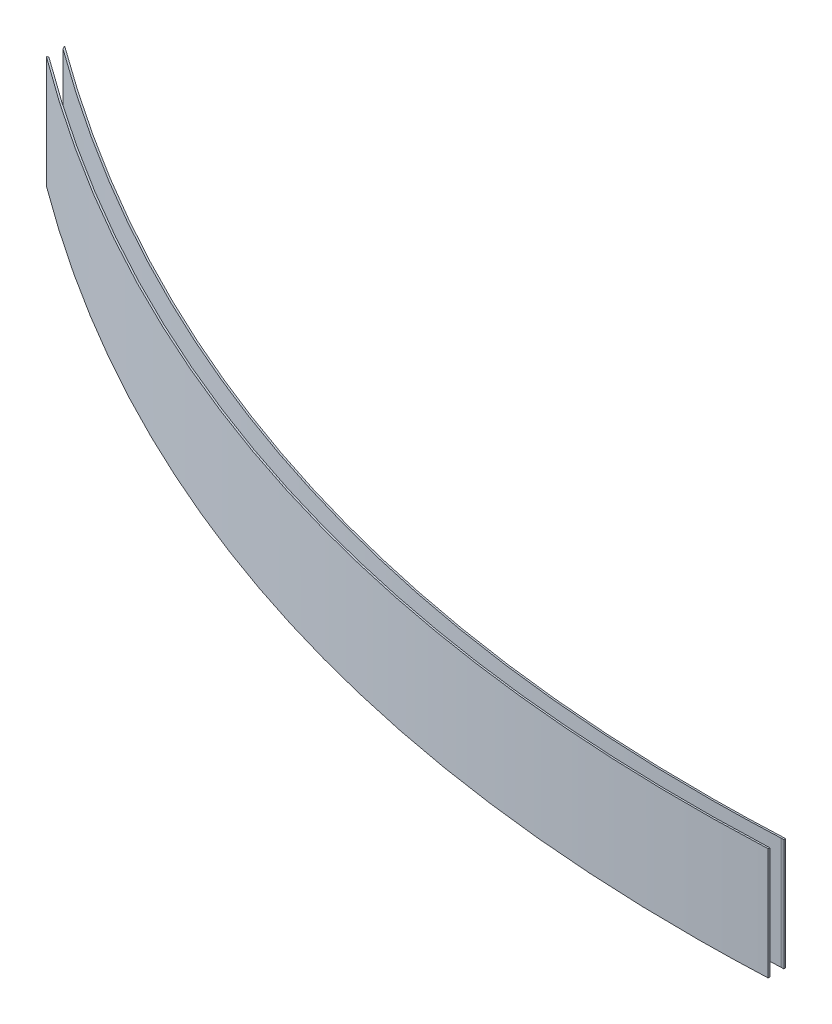
ISO-10303-21;
HEADER;
FILE_DESCRIPTION(('STEP AP214'),'2;1');
FILE_NAME('part.step','',(''),(''),'','','');
FILE_SCHEMA(('AUTOMOTIVE_DESIGN { 1 0 10303 214 1 1 1 1 }'));
ENDSEC;
DATA;
#1=APPLICATION_CONTEXT('core data for automotive mechanical design processes');
#2=APPLICATION_PROTOCOL_DEFINITION('international standard','automotive_design',2000,#1);
#3=PRODUCT_CONTEXT('',#1,'mechanical');
#4=PRODUCT('Part','Part','',(#3));
#5=PRODUCT_RELATED_PRODUCT_CATEGORY('part','',(#4));
#6=PRODUCT_DEFINITION_FORMATION('','',#4);
#7=PRODUCT_DEFINITION_CONTEXT('part definition',#1,'design');
#8=PRODUCT_DEFINITION('design','',#6,#7);
#9=PRODUCT_DEFINITION_SHAPE('','',#8);
#10=(LENGTH_UNIT() NAMED_UNIT(*) SI_UNIT(.MILLI.,.METRE.));
#11=(NAMED_UNIT(*) PLANE_ANGLE_UNIT() SI_UNIT($,.RADIAN.));
#12=(NAMED_UNIT(*) SI_UNIT($,.STERADIAN.) SOLID_ANGLE_UNIT());
#13=UNCERTAINTY_MEASURE_WITH_UNIT(LENGTH_MEASURE(1.E-05),#10,'distance_accuracy_value','');
#14=(GEOMETRIC_REPRESENTATION_CONTEXT(3) GLOBAL_UNCERTAINTY_ASSIGNED_CONTEXT((#13)) GLOBAL_UNIT_ASSIGNED_CONTEXT((#10,
#11,#12)) REPRESENTATION_CONTEXT('',''));
#15=CARTESIAN_POINT('',(0.,0.,0.));
#16=DIRECTION('',(0.,0.,1.));
#17=DIRECTION('',(1.,0.,0.));
#18=AXIS2_PLACEMENT_3D('',#15,#16,#17);
#19=CARTESIAN_POINT('',(-236.084098565073,705.3,-330.26408566738));
#20=DIRECTION('',(0.,1.,0.));
#21=DIRECTION('',(0.,0.,-1.));
#22=AXIS2_PLACEMENT_3D('',#19,#20,#21);
#23=PLANE('',#22);
#24=CARTESIAN_POINT('',(-65.6029870038505,705.3,-318.310693139276));
#25=CARTESIAN_POINT('',(-68.2691629825036,705.3,-318.183187046416));
#26=CARTESIAN_POINT('',(-70.9361555522906,705.3,-318.073376106954));
#27=CARTESIAN_POINT('',(-76.2713852542856,705.3,-317.889522387255));
#28=CARTESIAN_POINT('',(-78.9396223923947,705.3,-317.815479778372));
#29=CARTESIAN_POINT('',(-86.9473862895726,705.3,-317.647534916938));
#30=CARTESIAN_POINT('',(-92.2881597578225,705.3,-317.607902482869));
#31=CARTESIAN_POINT('',(-102.969854987151,705.3,-317.676073655154));
#32=CARTESIAN_POINT('',(-108.310776538044,705.3,-317.783908630168));
#33=CARTESIAN_POINT('',(-118.988092612427,705.3,-318.149436114162));
#34=CARTESIAN_POINT('',(-124.324486600366,705.3,-318.407144392248));
#35=CARTESIAN_POINT('',(-134.987971328782,705.3,-319.07437400729));
#36=CARTESIAN_POINT('',(-140.315061744115,705.3,-319.483900547421));
#37=CARTESIAN_POINT('',(-150.955217209216,705.3,-320.456234020843));
#38=CARTESIAN_POINT('',(-156.268282363942,705.3,-321.01903980378));
#39=CARTESIAN_POINT('',(-166.725987822131,705.3,-322.280831390952));
#40=CARTESIAN_POINT('',(-171.871146588405,705.3,-322.975521744442));
#41=CARTESIAN_POINT('',(-182.139119469575,705.3,-324.510919792214));
#42=CARTESIAN_POINT('',(-187.261935758724,705.3,-325.351612937876));
#43=CARTESIAN_POINT('',(-197.480920878812,705.3,-327.178919893074));
#44=CARTESIAN_POINT('',(-202.577092472965,705.3,-328.165518247619));
#45=CARTESIAN_POINT('',(-212.738589982239,705.3,-330.284063891744));
#46=CARTESIAN_POINT('',(-217.803919000081,705.3,-331.415996299166));
#47=CARTESIAN_POINT('',(-227.899635885535,705.3,-333.824165958377));
#48=CARTESIAN_POINT('',(-232.930027115684,705.3,-335.100389112966));
#49=CARTESIAN_POINT('',(-242.95185071161,705.3,-337.795614070396));
#50=CARTESIAN_POINT('',(-247.943286938129,705.3,-339.214601525475));
#51=CARTESIAN_POINT('',(-258.337345800253,705.3,-342.329437078258));
#52=CARTESIAN_POINT('',(-263.735942949794,705.3,-344.038732873943));
#53=CARTESIAN_POINT('',(-274.478583579159,705.3,-347.622282235918));
#54=CARTESIAN_POINT('',(-279.822622351469,705.3,-349.496549904616));
#55=CARTESIAN_POINT('',(-290.452310891855,705.3,-353.406660143415));
#56=CARTESIAN_POINT('',(-295.737950192759,705.3,-355.442531159847));
#57=CARTESIAN_POINT('',(-306.247175913095,705.3,-359.671966618089));
#58=CARTESIAN_POINT('',(-311.470747397068,705.3,-361.865568153882));
#59=CARTESIAN_POINT('',(-321.852374785991,705.3,-366.406113074929));
#60=CARTESIAN_POINT('',(-327.010413603648,705.3,-368.753095511605));
#61=CARTESIAN_POINT('',(-337.25768706161,705.3,-373.595592323015));
#62=CARTESIAN_POINT('',(-342.346905760605,705.3,-376.091140411643));
#63=CARTESIAN_POINT('',(-352.613968550303,705.3,-381.307086611694));
#64=CARTESIAN_POINT('',(-357.78945789645,705.3,-384.032118792804));
#65=CARTESIAN_POINT('',(-368.060581589295,705.3,-389.628462780461));
#66=CARTESIAN_POINT('',(-373.156217142842,705.3,-392.499772373491));
#67=CARTESIAN_POINT('',(-383.264815106663,705.3,-398.382127543981));
#68=CARTESIAN_POINT('',(-388.277793355456,705.3,-401.393145919068));
#69=CARTESIAN_POINT('',(-398.218479836666,705.3,-407.548011019785));
#70=CARTESIAN_POINT('',(-403.146224129469,705.3,-410.691799535078));
#71=CARTESIAN_POINT('',(-412.914028216126,705.3,-417.104955927536));
#72=CARTESIAN_POINT('',(-417.754150109865,705.3,-420.37422929732));
#73=CARTESIAN_POINT('',(-427.344583874759,705.3,-427.030819664629));
#74=CARTESIAN_POINT('',(-432.094989578501,705.3,-430.418001436099));
#75=CARTESIAN_POINT('',(-436.802987231457,705.3,-433.862922308594));
#76=B_SPLINE_CURVE_WITH_KNOTS('',3,(#24,#25,#26,#27,#28,#29,#30,#31,#32,#33,#34,#35,#36,#37,#38,
#39,#40,#41,#42,#43,#44,#45,#46,#47,#48,#49,#50,#51,#52,#53,#54,#55,#56,#57,#58,#59,#60,#61,#62,
#63,#64,#65,#66,#67,#68,#69,#70,#71,#72,#73,#74,#75),.UNSPECIFIED.,.F.,.F.,(4,2,2,2,2,2,2,2,2,2,
2,2,2,2,2,2,2,2,2,2,2,2,2,2,2,4),(0.,8.00754857334855,16.0151355077293,32.0357311751262,
48.0597352075981,64.0854255306863,80.1116651432765,96.1377844827726,111.711241231546,
127.283147034395,142.853404564952,158.422068976126,173.989213641732,189.554795374637,
206.540261002934,223.527180024817,240.517095839147,257.511020376539,274.509288623075,
291.511429087807,309.056157780186,326.600621058968,344.141682514485,361.675131707691,
379.195625386035,396.696647608506),.UNSPECIFIED.);
#77=CARTESIAN_POINT('',(-65.6029870038505,705.3,-318.310693139276));
#78=VERTEX_POINT('',#77);
#79=CARTESIAN_POINT('',(-436.80298723145,705.3,-433.862922308592));
#80=VERTEX_POINT('',#79);
#81=EDGE_CURVE('E111',#78,#80,#76,.T.);
#82=ORIENTED_EDGE('',*,*,#81,.F.);
#83=DIRECTION('',(3.33598704164609E-09,0.,-1.));
#84=VECTOR('',#83,1.);
#85=CARTESIAN_POINT('',(-65.6029870059495,705.3,-317.681641946463));
#86=LINE('',#85,#84);
#87=CARTESIAN_POINT('',(-65.6029870059495,705.3,-317.681641948464));
#88=VERTEX_POINT('',#87);
#89=EDGE_CURVE('E119',#88,#78,#86,.T.);
#90=ORIENTED_EDGE('',*,*,#89,.F.);
#91=DIRECTION('',(1.,0.,0.));
#92=VECTOR('',#91,1.);
#93=CARTESIAN_POINT('',(-236.084098565073,705.3,-317.681641948464));
#94=LINE('',#93,#92);
#95=CARTESIAN_POINT('',(-66.2029870059553,705.3,-317.681641948464));
#96=VERTEX_POINT('',#95);
#97=EDGE_CURVE('E150',#96,#88,#94,.T.);
#98=ORIENTED_EDGE('',*,*,#97,.F.);
#99=DIRECTION('',(0.998921745490793,0.,-0.0464257082404532));
#100=VECTOR('',#99,1.);
#101=CARTESIAN_POINT('',(-66.564204214343,705.3,-317.664854082143));
#102=LINE('',#101,#100);
#103=CARTESIAN_POINT('',(-66.564204214343,705.3,-317.664854082143));
#104=VERTEX_POINT('',#103);
#105=EDGE_CURVE('E155',#104,#96,#102,.T.);
#106=ORIENTED_EDGE('',*,*,#105,.F.);
#107=CARTESIAN_POINT('',(179399.129928406,705.3,-984620.675822957));
#108=CARTESIAN_POINT('',(-212077.093758222,705.3,976969.386915229));
#109=CARTESIAN_POINT('',(243907.016921872,705.3,-970636.245329767));
#110=B_SPLINE_CURVE_WITH_KNOTS('',2,(#107,#108,#109),.UNSPECIFIED.,.F.,.F.,(3,3),(0.,1.),.UNSPECIFIED.);
#111=CARTESIAN_POINT('',(-66.5668764567506,705.3,-317.664729887484));
#112=VERTEX_POINT('',#111);
#113=EDGE_CURVE('E128',#104,#112,#110,.F.);
#114=ORIENTED_EDGE('',*,*,#113,.T.);
#115=CARTESIAN_POINT('',(-436.202987182509,705.3,-432.681642064262));
#116=VERTEX_POINT('',#115);
#117=EDGE_CURVE('E129',#112,#116,#110,.F.);
#118=ORIENTED_EDGE('',*,*,#117,.T.);
#119=DIRECTION('',(0.452856269308282,0.,0.891583534700022));
#120=VECTOR('',#119,1.);
#121=CARTESIAN_POINT('',(-353.810815566412,705.3,-270.467914266485));
#122=LINE('',#121,#120);
#123=EDGE_CURVE('E124',#80,#116,#122,.T.);
#124=ORIENTED_EDGE('',*,*,#123,.F.);
#125=EDGE_LOOP('',(#82,#90,#98,#106,#114,#118,#124));
#126=FACE_BOUND('',#125,.T.);
#127=ADVANCED_FACE('F47',(#126),#23,.F.);
#128=CARTESIAN_POINT('',(-212.010166541518,745.,-329.536830566326));
#129=DIRECTION('',(0.,1.,0.));
#130=DIRECTION('',(0.,0.,-1.));
#131=AXIS2_PLACEMENT_3D('',#128,#129,#130);
#132=PLANE('',#131);
#133=DIRECTION('',(0.452856269308282,0.,0.891583534700022));
#134=VECTOR('',#133,1.);
#135=CARTESIAN_POINT('',(-436.202987182509,745.,-432.681642064262));
#136=LINE('',#135,#134);
#137=CARTESIAN_POINT('',(-436.80298723145,745.,-433.862922308592));
#138=VERTEX_POINT('',#137);
#139=CARTESIAN_POINT('',(-436.202987182509,745.,-432.681642064262));
#140=VERTEX_POINT('',#139);
#141=EDGE_CURVE('E12',#138,#140,#136,.T.);
#142=ORIENTED_EDGE('',*,*,#141,.T.);
#143=CARTESIAN_POINT('',(179399.129928406,745.,-984620.675822957));
#144=CARTESIAN_POINT('',(-212077.093758222,745.,976969.386915229));
#145=CARTESIAN_POINT('',(243907.016921872,745.,-970636.245329767));
#146=B_SPLINE_CURVE_WITH_KNOTS('',2,(#143,#144,#145),.UNSPECIFIED.,.F.,.F.,(3,3),(0.,1.),.UNSPECIFIED.);
#147=CARTESIAN_POINT('',(-66.5668764558678,745.,-317.664729884103));
#148=VERTEX_POINT('',#147);
#149=EDGE_CURVE('E131',#140,#148,#146,.T.);
#150=ORIENTED_EDGE('',*,*,#149,.T.);
#151=DIRECTION('',(0.998921745490792,0.,-0.0464257082404641));
#152=VECTOR('',#151,1.);
#153=CARTESIAN_POINT('',(-66.5642042129753,745.,-317.664854082207));
#154=LINE('',#153,#152);
#155=CARTESIAN_POINT('',(-66.2029870059495,745.,-317.681641948464));
#156=VERTEX_POINT('',#155);
#157=EDGE_CURVE('E139',#156,#148,#154,.F.);
#158=ORIENTED_EDGE('',*,*,#157,.F.);
#159=DIRECTION('',(1.,0.,0.));
#160=VECTOR('',#159,1.);
#161=CARTESIAN_POINT('',(-66.2029870059495,745.,-317.681641948464));
#162=LINE('',#161,#160);
#163=CARTESIAN_POINT('',(-65.6029870038505,745.,-317.681641948464));
#164=VERTEX_POINT('',#163);
#165=EDGE_CURVE('E157',#156,#164,#162,.T.);
#166=ORIENTED_EDGE('',*,*,#165,.T.);
#167=DIRECTION('',(-3.33598704164609E-09,0.,1.));
#168=VECTOR('',#167,1.);
#169=CARTESIAN_POINT('',(-65.6029869664008,745.,-329.536830077914));
#170=LINE('',#169,#168);
#171=CARTESIAN_POINT('',(-65.6029870038505,745.,-318.310693139276));
#172=VERTEX_POINT('',#171);
#173=EDGE_CURVE('E51',#172,#164,#170,.T.);
#174=ORIENTED_EDGE('',*,*,#173,.F.);
#175=CARTESIAN_POINT('',(-436.80298723145,745.,-433.862922308592));
#176=CARTESIAN_POINT('',(-432.279255756403,745.,-430.55283592515));
#177=CARTESIAN_POINT('',(-427.716380805868,745.,-427.296059412836));
#178=CARTESIAN_POINT('',(-418.50825169473,745.,-420.891282643582));
#179=CARTESIAN_POINT('',(-413.86292067398,745.,-417.743392916555));
#180=CARTESIAN_POINT('',(-404.491646218644,745.,-411.563075128013));
#181=CARTESIAN_POINT('',(-399.765651911941,745.,-408.530724147033));
#182=CARTESIAN_POINT('',(-390.235068970205,745.,-402.587926236768));
#183=CARTESIAN_POINT('',(-385.430450818185,745.,-399.677526621532));
#184=CARTESIAN_POINT('',(-375.744798513768,745.,-393.984783776664));
#185=CARTESIAN_POINT('',(-370.863751469657,745.,-391.20246246949));
#186=CARTESIAN_POINT('',(-361.027611925824,745.,-385.771719612806));
#187=CARTESIAN_POINT('',(-356.072518596553,745.,-383.123299564861));
#188=CARTESIAN_POINT('',(-346.238770653325,745.,-378.042292576845));
#189=CARTESIAN_POINT('',(-341.362222313244,745.,-375.605630019498));
#190=CARTESIAN_POINT('',(-331.544616363603,745.,-370.868404442039));
#191=CARTESIAN_POINT('',(-326.603571709451,745.,-368.567814587249));
#192=CARTESIAN_POINT('',(-316.659747663615,745.,-364.107101569605));
#193=CARTESIAN_POINT('',(-311.656981986963,745.,-361.946947846233));
#194=CARTESIAN_POINT('',(-301.592643904598,745.,-357.771088333706));
#195=CARTESIAN_POINT('',(-296.531083180593,745.,-355.755354402228));
#196=CARTESIAN_POINT('',(-286.352250622464,745.,-351.871919508155));
#197=CARTESIAN_POINT('',(-281.234986407354,745.,-350.004198582943));
#198=CARTESIAN_POINT('',(-270.948010590076,745.,-346.419961853068));
#199=CARTESIAN_POINT('',(-265.778301322965,745.,-344.703439349132));
#200=CARTESIAN_POINT('',(-255.429941826647,745.,-341.436991397288));
#201=CARTESIAN_POINT('',(-250.251661926368,745.,-339.885892915898));
#202=CARTESIAN_POINT('',(-239.850713429572,745.,-336.937627705568));
#203=CARTESIAN_POINT('',(-234.628039042734,745.,-335.54048139885));
#204=CARTESIAN_POINT('',(-224.142786614678,745.,-332.902097236991));
#205=CARTESIAN_POINT('',(-218.880203866106,745.,-331.660878087223));
#206=CARTESIAN_POINT('',(-208.319742254665,745.,-329.335763154947));
#207=CARTESIAN_POINT('',(-203.021859272459,745.,-328.251886081979));
#208=CARTESIAN_POINT('',(-192.395526399523,745.,-326.24230965986));
#209=CARTESIAN_POINT('',(-187.06707294104,745.,-325.316629177942));
#210=CARTESIAN_POINT('',(-176.384459892603,745.,-323.623741533817));
#211=CARTESIAN_POINT('',(-171.03029752171,745.,-322.856551929623));
#212=CARTESIAN_POINT('',(-160.139781371167,745.,-321.459677679548));
#213=CARTESIAN_POINT('',(-154.602805468541,745.,-320.834841283108));
#214=CARTESIAN_POINT('',(-143.512527106277,745.,-319.752161807083));
#215=CARTESIAN_POINT('',(-137.959224503256,745.,-319.294320198505));
#216=CARTESIAN_POINT('',(-126.841646292097,745.,-318.544085155538));
#217=CARTESIAN_POINT('',(-121.277371038054,745.,-318.251686467104));
#218=CARTESIAN_POINT('',(-110.143266246472,745.,-317.830220995766));
#219=CARTESIAN_POINT('',(-104.573437348723,745.,-317.701137181789));
#220=CARTESIAN_POINT('',(-93.4335333401742,745.,-317.603642572535));
#221=CARTESIAN_POINT('',(-87.863458546735,745.,-317.635196817593));
#222=CARTESIAN_POINT('',(-79.5119150084561,745.,-317.800639622011));
#223=CARTESIAN_POINT('',(-76.7291522792474,745.,-317.875448867259));
#224=CARTESIAN_POINT('',(-71.1649597337781,745.,-318.063987860901));
#225=CARTESIAN_POINT('',(-68.3835299103828,745.,-318.177717398576));
#226=CARTESIAN_POINT('',(-65.6029870038505,745.,-318.310693139276));
#227=B_SPLINE_CURVE_WITH_KNOTS('',3,(#175,#176,#177,#178,#179,#180,#181,#182,#183,#184,#185,
#186,#187,#188,#189,#190,#191,#192,#193,#194,#195,#196,#197,#198,#199,#200,#201,#202,#203,#204,
#205,#206,#207,#208,#209,#210,#211,#212,#213,#214,#215,#216,#217,#218,#219,#220,#221,#222,#223,
#224,#225,#226),.UNSPECIFIED.,.F.,.F.,(4,2,2,2,2,2,2,2,2,2,2,2,2,2,2,2,2,2,2,2,2,2,2,2,2,4),(0.,
16.8160550823314,33.6487068955703,50.4923985401429,67.3425657215014,84.1956064097527,
101.04883604582,117.401086820433,133.750101967623,150.095547389379,166.437798948294,
182.777842652134,199.117161999722,215.331599508683,231.548185329037,247.766714673516,
263.987170985665,280.209560473995,296.433746156341,313.147539689226,329.861480445417,
346.574890379593,363.286557234338,379.994587284088,388.345657910788,396.696683324666),.UNSPECIFIED.);
#228=EDGE_CURVE('E108',#138,#172,#227,.T.);
#229=ORIENTED_EDGE('',*,*,#228,.F.);
#230=EDGE_LOOP('',(#142,#150,#158,#166,#174,#229));
#231=FACE_BOUND('',#230,.T.);
#232=ADVANCED_FACE('F115',(#231),#132,.T.);
#233=CARTESIAN_POINT('',(179399.129928406,314.960432392313,-984620.675822957));
#234=CARTESIAN_POINT('',(-212077.093758222,314.960432392313,976969.386915229));
#235=CARTESIAN_POINT('',(243907.016921872,314.960432392313,-970636.245329767));
#236=B_SPLINE_CURVE_WITH_KNOTS('',2,(#233,#234,#235),.UNSPECIFIED.,.F.,.F.,(3,3),(0.,1.),.UNSPECIFIED.);
#237=DIRECTION('',(0.,1.,0.));
#238=VECTOR('',#237,1.);
#239=SURFACE_OF_LINEAR_EXTRUSION('',#236,#238);
#240=OFFSET_SURFACE('',#239,-0.6,.F.);
#241=ORIENTED_EDGE('',*,*,#81,.T.);
#242=DIRECTION('',(0.,1.,0.));
#243=VECTOR('',#242,1.);
#244=CARTESIAN_POINT('',(-436.802987231448,705.3,-433.862922308592));
#245=LINE('',#244,#243);
#246=EDGE_CURVE('E57',#80,#138,#245,.T.);
#247=ORIENTED_EDGE('',*,*,#246,.T.);
#248=ORIENTED_EDGE('',*,*,#228,.T.);
#249=DIRECTION('',(0.,1.,0.));
#250=VECTOR('',#249,1.);
#251=CARTESIAN_POINT('',(-65.6029870038505,705.3,-318.310693139276));
#252=LINE('',#251,#250);
#253=EDGE_CURVE('E136',#78,#172,#252,.T.);
#254=ORIENTED_EDGE('',*,*,#253,.F.);
#255=EDGE_LOOP('',(#241,#247,#248,#254));
#256=FACE_BOUND('',#255,.T.);
#257=ADVANCED_FACE('F107',(#256),#240,.F.);
#258=CARTESIAN_POINT('',(-65.6029870059495,314.960432392313,-317.681641946463));
#259=DIRECTION('',(1.,0.,3.33598704164609E-09));
#260=DIRECTION('',(-3.33598704164609E-09,0.,1.));
#261=AXIS2_PLACEMENT_3D('',#258,#259,#260);
#262=PLANE('',#261);
#263=DIRECTION('',(0.,-1.,0.));
#264=VECTOR('',#263,1.);
#265=CARTESIAN_POINT('',(-65.6029870059495,314.960432392313,-317.681641948464));
#266=LINE('',#265,#264);
#267=EDGE_CURVE('E112',#164,#88,#266,.T.);
#268=ORIENTED_EDGE('',*,*,#267,.T.);
#269=ORIENTED_EDGE('',*,*,#89,.T.);
#270=ORIENTED_EDGE('',*,*,#253,.T.);
#271=ORIENTED_EDGE('',*,*,#173,.T.);
#272=EDGE_LOOP('',(#268,#269,#270,#271));
#273=FACE_BOUND('',#272,.T.);
#274=ADVANCED_FACE('F164',(#273),#262,.T.);
#275=CARTESIAN_POINT('',(179399.129928406,314.960432392313,-984620.675822957));
#276=CARTESIAN_POINT('',(-212077.093758222,314.960432392313,976969.386915229));
#277=CARTESIAN_POINT('',(243907.016921872,314.960432392313,-970636.245329767));
#278=B_SPLINE_CURVE_WITH_KNOTS('',2,(#275,#276,#277),.UNSPECIFIED.,.F.,.F.,(3,3),(0.,1.),.UNSPECIFIED.);
#279=DIRECTION('',(0.,1.,0.));
#280=VECTOR('',#279,1.);
#281=SURFACE_OF_LINEAR_EXTRUSION('',#278,#280);
#282=ORIENTED_EDGE('',*,*,#149,.F.);
#283=DIRECTION('',(0.,1.,0.));
#284=VECTOR('',#283,1.);
#285=CARTESIAN_POINT('',(-436.202987182509,314.960432392313,-432.681642064262));
#286=LINE('',#285,#284);
#287=EDGE_CURVE('E122',#116,#140,#286,.T.);
#288=ORIENTED_EDGE('',*,*,#287,.F.);
#289=ORIENTED_EDGE('',*,*,#117,.F.);
#290=DIRECTION('',(0.,1.,0.));
#291=VECTOR('',#290,1.);
#292=CARTESIAN_POINT('',(-66.5668764567506,685.,-317.664729887484));
#293=LINE('',#292,#291);
#294=EDGE_CURVE('E133',#112,#148,#293,.T.);
#295=ORIENTED_EDGE('',*,*,#294,.T.);
#296=EDGE_LOOP('',(#282,#288,#289,#295));
#297=FACE_BOUND('',#296,.T.);
#298=ADVANCED_FACE('F132',(#297),#281,.T.);
#299=CARTESIAN_POINT('',(-66.5668764567506,685.,-317.664729887484));
#300=DIRECTION('',(-0.0464257082403459,0.,-0.998921745490798));
#301=DIRECTION('',(0.998921745490798,0.,-0.0464257082403459));
#302=AXIS2_PLACEMENT_3D('',#299,#300,#301);
#303=PLANE('',#302);
#304=ORIENTED_EDGE('',*,*,#113,.F.);
#305=ORIENTED_EDGE('',*,*,#105,.T.);
#306=DIRECTION('',(0.,1.,0.));
#307=VECTOR('',#306,1.);
#308=CARTESIAN_POINT('',(-66.2029870059495,685.,-317.681641948464));
#309=LINE('',#308,#307);
#310=EDGE_CURVE('E101',#96,#156,#309,.T.);
#311=ORIENTED_EDGE('',*,*,#310,.T.);
#312=ORIENTED_EDGE('',*,*,#157,.T.);
#313=ORIENTED_EDGE('',*,*,#294,.F.);
#314=EDGE_LOOP('',(#304,#305,#311,#312,#313));
#315=FACE_BOUND('',#314,.T.);
#316=ADVANCED_FACE('F185',(#315),#303,.F.);
#317=CARTESIAN_POINT('',(-66.2029870059495,685.,-317.681641948464));
#318=DIRECTION('',(0.,0.,-1.));
#319=DIRECTION('',(1.,0.,0.));
#320=AXIS2_PLACEMENT_3D('',#317,#318,#319);
#321=PLANE('',#320);
#322=ORIENTED_EDGE('',*,*,#310,.F.);
#323=ORIENTED_EDGE('',*,*,#97,.T.);
#324=ORIENTED_EDGE('',*,*,#267,.F.);
#325=ORIENTED_EDGE('',*,*,#165,.F.);
#326=EDGE_LOOP('',(#322,#323,#324,#325));
#327=FACE_BOUND('',#326,.T.);
#328=ADVANCED_FACE('F194',(#327),#321,.F.);
#329=CARTESIAN_POINT('',(-436.202987182509,685.,-432.681642064262));
#330=DIRECTION('',(0.891583534700022,0.,-0.452856269308282));
#331=DIRECTION('',(0.452856269308282,0.,0.891583534700022));
#332=AXIS2_PLACEMENT_3D('',#329,#330,#331);
#333=PLANE('',#332);
#334=ORIENTED_EDGE('',*,*,#246,.F.);
#335=ORIENTED_EDGE('',*,*,#123,.T.);
#336=ORIENTED_EDGE('',*,*,#287,.T.);
#337=ORIENTED_EDGE('',*,*,#141,.F.);
#338=EDGE_LOOP('',(#334,#335,#336,#337));
#339=FACE_BOUND('',#338,.T.);
#340=ADVANCED_FACE('F121',(#339),#333,.F.);
#341=CLOSED_SHELL('',(#127,#232,#257,#274,#298,#316,#328,#340));
#342=MANIFOLD_SOLID_BREP('B2',#341);
#343=CARTESIAN_POINT('',(-65.6029870059495,314.960432392313,-317.681641946463));
#344=DIRECTION('',(1.,0.,3.33598704164609E-09));
#345=DIRECTION('',(-3.33598704164609E-09,0.,1.));
#346=AXIS2_PLACEMENT_3D('',#343,#344,#345);
#347=PLANE('',#346);
#348=DIRECTION('',(0.,1.,0.));
#349=VECTOR('',#348,1.);
#350=CARTESIAN_POINT('',(-65.6029870226558,314.960432392313,-312.673734300305));
#351=LINE('',#350,#349);
#352=CARTESIAN_POINT('',(-65.6029870226558,705.3,-312.673734300305));
#353=VERTEX_POINT('',#352);
#354=CARTESIAN_POINT('',(-65.6029870038505,745.,-312.673734300454));
#355=VERTEX_POINT('',#354);
#356=EDGE_CURVE('E369',#353,#355,#351,.T.);
#357=ORIENTED_EDGE('',*,*,#356,.T.);
#358=DIRECTION('',(-3.33598704164609E-09,0.,1.));
#359=VECTOR('',#358,1.);
#360=CARTESIAN_POINT('',(-65.6029869664008,745.,-329.536830077914));
#361=LINE('',#360,#359);
#362=CARTESIAN_POINT('',(-65.6029870245519,745.,-312.107195518563));
#363=VERTEX_POINT('',#362);
#364=EDGE_CURVE('E325',#355,#363,#361,.T.);
#365=ORIENTED_EDGE('',*,*,#364,.T.);
#366=DIRECTION('',(0.,1.,0.));
#367=VECTOR('',#366,1.);
#368=CARTESIAN_POINT('',(-65.6029870245489,705.3,-312.107195518563));
#369=LINE('',#368,#367);
#370=CARTESIAN_POINT('',(-65.6029870245489,705.3,-312.107195518563));
#371=VERTEX_POINT('',#370);
#372=EDGE_CURVE('E362',#371,#363,#369,.T.);
#373=ORIENTED_EDGE('',*,*,#372,.F.);
#374=DIRECTION('',(3.33598704164609E-09,0.,-1.));
#375=VECTOR('',#374,1.);
#376=CARTESIAN_POINT('',(-65.6029870059495,705.3,-317.681641946463));
#377=LINE('',#376,#375);
#378=EDGE_CURVE('E265',#371,#353,#377,.T.);
#379=ORIENTED_EDGE('',*,*,#378,.T.);
#380=EDGE_LOOP('',(#357,#365,#373,#379));
#381=FACE_BOUND('',#380,.T.);
#382=ADVANCED_FACE('F258',(#381),#347,.T.);
#383=CARTESIAN_POINT('',(-64.608203727472,685.,-312.681641947686));
#384=DIRECTION('',(0.00794886443687775,0.,0.999968407278032));
#385=DIRECTION('',(-0.999968407278032,0.,0.00794886443687775));
#386=AXIS2_PLACEMENT_3D('',#383,#384,#385);
#387=PLANE('',#386);
#388=ORIENTED_EDGE('',*,*,#356,.F.);
#389=DIRECTION('',(-0.999968407278032,0.,0.00794886443687775));
#390=VECTOR('',#389,1.);
#391=CARTESIAN_POINT('',(-235.9335079095,705.3,-311.319757304493));
#392=LINE('',#391,#390);
#393=CARTESIAN_POINT('',(-66.5668764567506,705.3,-312.666072231795));
#394=VERTEX_POINT('',#393);
#395=EDGE_CURVE('E320',#353,#394,#392,.T.);
#396=ORIENTED_EDGE('',*,*,#395,.T.);
#397=DIRECTION('',(0.,1.,0.));
#398=VECTOR('',#397,1.);
#399=CARTESIAN_POINT('',(-66.5668764567364,725.15,-312.666072231805));
#400=LINE('',#399,#398);
#401=CARTESIAN_POINT('',(-66.5668770191505,745.,-312.666072207901));
#402=VERTEX_POINT('',#401);
#403=EDGE_CURVE('E45',#394,#402,#400,.T.);
#404=ORIENTED_EDGE('',*,*,#403,.T.);
#405=DIRECTION('',(-0.999968407278032,0.,0.00794886443687775));
#406=VECTOR('',#405,1.);
#407=CARTESIAN_POINT('',(-64.608203727472,745.,-312.681641947686));
#408=LINE('',#407,#406);
#409=EDGE_CURVE('E319',#355,#402,#408,.T.);
#410=ORIENTED_EDGE('',*,*,#409,.F.);
#411=EDGE_LOOP('',(#388,#396,#404,#410));
#412=FACE_BOUND('',#411,.T.);
#413=ADVANCED_FACE('F342',(#412),#387,.F.);
#414=CARTESIAN_POINT('',(285136.696023591,314.960432392313,-959317.615852084));
#415=CARTESIAN_POINT('',(-253607.150543159,314.960432392313,967038.901584155));
#416=CARTESIAN_POINT('',(221133.268668467,314.960432392313,-976081.243658898));
#417=B_SPLINE_CURVE_WITH_KNOTS('',2,(#414,#415,#416),.UNSPECIFIED.,.F.,.F.,(3,3),(0.,1.),.UNSPECIFIED.);
#418=DIRECTION('',(0.,1.,0.));
#419=VECTOR('',#418,1.);
#420=SURFACE_OF_LINEAR_EXTRUSION('',#417,#419);
#421=CARTESIAN_POINT('',(285136.696023591,705.3,-959317.615852084));
#422=CARTESIAN_POINT('',(-253607.150543159,705.3,967038.901584155));
#423=CARTESIAN_POINT('',(221133.268668467,705.3,-976081.243658898));
#424=B_SPLINE_CURVE_WITH_KNOTS('',2,(#421,#422,#423),.UNSPECIFIED.,.F.,.F.,(3,3),(0.,1.),.UNSPECIFIED.);
#425=CARTESIAN_POINT('',(-436.202986975316,705.3,-427.681641912946));
#426=VERTEX_POINT('',#425);
#427=EDGE_CURVE('E323',#426,#394,#424,.F.);
#428=ORIENTED_EDGE('',*,*,#427,.F.);
#429=DIRECTION('',(0.,1.,0.));
#430=VECTOR('',#429,1.);
#431=CARTESIAN_POINT('',(-436.202986975374,314.960432392313,-427.681641912883));
#432=LINE('',#431,#430);
#433=CARTESIAN_POINT('',(-436.202986975374,745.,-427.681641912883));
#434=VERTEX_POINT('',#433);
#435=EDGE_CURVE('E310',#426,#434,#432,.T.);
#436=ORIENTED_EDGE('',*,*,#435,.T.);
#437=CARTESIAN_POINT('',(285136.696023591,745.,-959317.615852084));
#438=CARTESIAN_POINT('',(-253607.150543159,745.,967038.901584155));
#439=CARTESIAN_POINT('',(221133.268668467,745.,-976081.243658898));
#440=B_SPLINE_CURVE_WITH_KNOTS('',2,(#437,#438,#439),.UNSPECIFIED.,.F.,.F.,(3,3),(0.,1.),.UNSPECIFIED.);
#441=EDGE_CURVE('E272',#402,#434,#440,.T.);
#442=ORIENTED_EDGE('',*,*,#441,.F.);
#443=ORIENTED_EDGE('',*,*,#403,.F.);
#444=EDGE_LOOP('',(#428,#436,#442,#443));
#445=FACE_BOUND('',#444,.T.);
#446=ADVANCED_FACE('F322',(#445),#420,.T.);
#447=CARTESIAN_POINT('',(-212.010166541518,745.,-329.536830566326));
#448=DIRECTION('',(0.,1.,0.));
#449=DIRECTION('',(0.,0.,-1.));
#450=AXIS2_PLACEMENT_3D('',#447,#448,#449);
#451=PLANE('',#450);
#452=DIRECTION('',(-0.892730946928028,0.,0.450590120172409));
#453=VECTOR('',#452,1.);
#454=CARTESIAN_POINT('',(-436.202986975374,745.,-427.681641912883));
#455=LINE('',#454,#453);
#456=CARTESIAN_POINT('',(-436.802986962826,745.,-427.378802555315));
#457=VERTEX_POINT('',#456);
#458=EDGE_CURVE('E308',#434,#457,#455,.T.);
#459=ORIENTED_EDGE('',*,*,#458,.T.);
#460=CARTESIAN_POINT('',(-65.6029870245519,745.,-312.107195518563));
#461=CARTESIAN_POINT('',(-68.8360655848659,745.,-311.96495440707));
#462=CARTESIAN_POINT('',(-72.0701963345177,745.,-311.847702251562));
#463=CARTESIAN_POINT('',(-78.5399250136832,745.,-311.663890674077));
#464=CARTESIAN_POINT('',(-81.7755229559784,745.,-311.597331702551));
#465=CARTESIAN_POINT('',(-91.4870116238964,745.,-311.474725307814));
#466=CARTESIAN_POINT('',(-97.9640627894625,745.,-311.495905433628));
#467=CARTESIAN_POINT('',(-110.916019717675,745.,-311.749375253086));
#468=CARTESIAN_POINT('',(-117.390924154514,745.,-311.981731692027));
#469=CARTESIAN_POINT('',(-130.330312835101,745.,-312.662159463947));
#470=CARTESIAN_POINT('',(-136.794795612366,745.,-313.110258879267));
#471=CARTESIAN_POINT('',(-149.704921693366,745.,-314.225842725688));
#472=CARTESIAN_POINT('',(-156.150564782858,745.,-314.89332964193));
#473=CARTESIAN_POINT('',(-168.830746909082,745.,-316.428093282491));
#474=CARTESIAN_POINT('',(-175.066044665544,745.,-317.28910012314));
#475=CARTESIAN_POINT('',(-187.502902508504,745.,-319.222078009508));
#476=CARTESIAN_POINT('',(-193.704467648199,745.,-320.294016509993));
#477=CARTESIAN_POINT('',(-206.066302262224,745.,-322.649348069743));
#478=CARTESIAN_POINT('',(-212.226578159184,745.,-323.932707408446));
#479=CARTESIAN_POINT('',(-224.498496892596,745.,-326.710404031752));
#480=CARTESIAN_POINT('',(-230.610146348949,745.,-328.20471206052));
#481=CARTESIAN_POINT('',(-242.77764624419,745.,-331.402837721937));
#482=CARTESIAN_POINT('',(-248.833502703756,745.,-333.106632457142));
#483=CARTESIAN_POINT('',(-261.303206849177,745.,-336.847515389385));
#484=CARTESIAN_POINT('',(-267.712572620807,745.,-338.899559709637));
#485=CARTESIAN_POINT('',(-280.452807413354,745.,-343.236946063103));
#486=CARTESIAN_POINT('',(-286.783665511531,745.,-345.522320159905));
#487=CARTESIAN_POINT('',(-299.359842608097,745.,-350.321362762269));
#488=CARTESIAN_POINT('',(-305.605142185614,745.,-352.835082143115));
#489=CARTESIAN_POINT('',(-318.0035593631,745.,-358.084740034403));
#490=CARTESIAN_POINT('',(-324.156651845315,745.,-360.820737836763));
#491=CARTESIAN_POINT('',(-336.364426133074,745.,-366.507845131743));
#492=CARTESIAN_POINT('',(-342.419082793259,745.,-369.459008564271));
#493=CARTESIAN_POINT('',(-354.613126433797,745.,-375.664526043001));
#494=CARTESIAN_POINT('',(-360.749134311021,745.,-378.925518160327));
#495=CARTESIAN_POINT('',(-372.90424055894,745.,-385.657816073886));
#496=CARTESIAN_POINT('',(-378.923343885706,745.,-389.12911292861));
#497=CARTESIAN_POINT('',(-390.839530252551,745.,-396.271325078874));
#498=CARTESIAN_POINT('',(-396.736646717361,745.,-399.942184666095));
#499=CARTESIAN_POINT('',(-408.404397200775,745.,-407.472123920745));
#500=CARTESIAN_POINT('',(-414.175106467215,745.,-411.33108694291));
#501=CARTESIAN_POINT('',(-422.734475326974,745.,-417.252375584052));
#502=CARTESIAN_POINT('',(-425.570058564693,745.,-419.247226242331));
#503=CARTESIAN_POINT('',(-431.209965781376,745.,-423.280573146121));
#504=CARTESIAN_POINT('',(-434.014290122211,745.,-425.319068885572));
#505=CARTESIAN_POINT('',(-436.802986962826,745.,-427.378802555315));
#506=B_SPLINE_CURVE_WITH_KNOTS('',3,(#460,#461,#462,#463,#464,#465,#466,#467,#468,#469,#470,
#471,#472,#473,#474,#475,#476,#477,#478,#479,#480,#481,#482,#483,#484,#485,#486,#487,#488,#489,
#490,#491,#492,#493,#494,#495,#496,#497,#498,#499,#500,#501,#502,#503,#504,#505),.UNSPECIFIED.,
.F.,.F.,(4,2,2,2,2,2,2,2,2,2,2,2,2,2,2,2,2,2,2,2,2,2,4),(0.,9.70842084142319,19.4169279493336,
38.8445510406184,58.2783166464797,77.7146125465992,97.151128621337,116.030950401179,
134.907861441507,153.781764619089,172.653052799137,191.522280128832,211.707236019532,
231.89496941882,252.087211724763,272.284858031249,292.48758521538,313.329439794875,
334.170408864022,355.005589715533,375.828010822125,386.228600761917,396.6290701731),.UNSPECIFIED.);
#507=EDGE_CURVE('E356',#363,#457,#506,.T.);
#508=ORIENTED_EDGE('',*,*,#507,.F.);
#509=ORIENTED_EDGE('',*,*,#364,.F.);
#510=ORIENTED_EDGE('',*,*,#409,.T.);
#511=ORIENTED_EDGE('',*,*,#441,.T.);
#512=EDGE_LOOP('',(#459,#508,#509,#510,#511));
#513=FACE_BOUND('',#512,.T.);
#514=ADVANCED_FACE('F317',(#513),#451,.T.);
#515=CARTESIAN_POINT('',(285136.696023591,314.960432392313,-959317.615852084));
#516=CARTESIAN_POINT('',(-253607.150543159,314.960432392313,967038.901584155));
#517=CARTESIAN_POINT('',(221133.268668467,314.960432392313,-976081.243658898));
#518=B_SPLINE_CURVE_WITH_KNOTS('',2,(#515,#516,#517),.UNSPECIFIED.,.F.,.F.,(3,3),(0.,1.),.UNSPECIFIED.);
#519=DIRECTION('',(0.,1.,0.));
#520=VECTOR('',#519,1.);
#521=SURFACE_OF_LINEAR_EXTRUSION('',#518,#520);
#522=OFFSET_SURFACE('',#521,-0.6,.F.);
#523=CARTESIAN_POINT('',(-436.802986962826,705.3,-427.378802555315));
#524=CARTESIAN_POINT('',(-432.357573914022,705.3,-424.095380200365));
#525=CARTESIAN_POINT('',(-427.872237236557,705.3,-420.865836271993));
#526=CARTESIAN_POINT('',(-418.818627721933,705.3,-414.516948944963));
#527=CARTESIAN_POINT('',(-414.250288312721,705.3,-411.397700501685));
#528=CARTESIAN_POINT('',(-405.032523436767,705.3,-405.275700479121));
#529=CARTESIAN_POINT('',(-400.3830546593,705.3,-402.273014066987));
#530=CARTESIAN_POINT('',(-391.005157561634,705.3,-396.390146252628));
#531=CARTESIAN_POINT('',(-386.276704610613,705.3,-393.510004097315));
#532=CARTESIAN_POINT('',(-376.743144840293,705.3,-387.877915826974));
#533=CARTESIAN_POINT('',(-371.938027563969,705.3,-385.125987404507));
#534=CARTESIAN_POINT('',(-362.253657075411,705.3,-379.755677939082));
#535=CARTESIAN_POINT('',(-357.374403396732,705.3,-377.137297736822));
#536=CARTESIAN_POINT('',(-347.688476837849,705.3,-372.113746430338));
#537=CARTESIAN_POINT('',(-342.883880461363,705.3,-369.704572155707));
#538=CARTESIAN_POINT('',(-333.210395160166,705.3,-365.021109531586));
#539=CARTESIAN_POINT('',(-328.341517615143,705.3,-362.746797688732));
#540=CARTESIAN_POINT('',(-318.542434110656,705.3,-358.336908741613));
#541=CARTESIAN_POINT('',(-313.612240064375,705.3,-356.201305174345));
#542=CARTESIAN_POINT('',(-303.693651471857,705.3,-352.072273212178));
#543=CARTESIAN_POINT('',(-298.705267122614,705.3,-350.078820330333));
#544=CARTESIAN_POINT('',(-288.673599750786,705.3,-346.23711422357));
#545=CARTESIAN_POINT('',(-283.630323706244,705.3,-344.388842782517));
#546=CARTESIAN_POINT('',(-273.492357977128,705.3,-340.840097233906));
#547=CARTESIAN_POINT('',(-268.397671287743,705.3,-339.139614571009));
#548=CARTESIAN_POINT('',(-258.057204568689,705.3,-335.855788058485));
#549=CARTESIAN_POINT('',(-252.810451781993,705.3,-334.275505948789));
#550=CARTESIAN_POINT('',(-242.271259471402,705.3,-331.272804524742));
#551=CARTESIAN_POINT('',(-236.978814328544,705.3,-329.850404932629));
#552=CARTESIAN_POINT('',(-226.352896276705,705.3,-327.164882799336));
#553=CARTESIAN_POINT('',(-221.019417853299,705.3,-325.901782077386));
#554=CARTESIAN_POINT('',(-210.316224324602,705.3,-323.535704103402));
#555=CARTESIAN_POINT('',(-204.946503879948,705.3,-322.432751008904));
#556=CARTESIAN_POINT('',(-194.175737993602,705.3,-320.387249576568));
#557=CARTESIAN_POINT('',(-188.774687794206,705.3,-319.444726297834));
#558=CARTESIAN_POINT('',(-177.946306240679,705.3,-317.719808844371));
#559=CARTESIAN_POINT('',(-172.518971242643,705.3,-316.937437562378));
#560=CARTESIAN_POINT('',(-161.476559328314,705.3,-315.510469369479));
#561=CARTESIAN_POINT('',(-155.860839527086,705.3,-314.87084662983));
#562=CARTESIAN_POINT('',(-144.612838226447,705.3,-313.759323138391));
#563=CARTESIAN_POINT('',(-138.980556671698,705.3,-313.287422947669));
#564=CARTESIAN_POINT('',(-127.704998046978,705.3,-312.509209922284));
#565=CARTESIAN_POINT('',(-122.06172180838,705.3,-312.20288502066));
#566=CARTESIAN_POINT('',(-110.769804730855,705.3,-311.753137560255));
#567=CARTESIAN_POINT('',(-105.121165112379,705.3,-311.609684116282));
#568=CARTESIAN_POINT('',(-93.8240464001927,705.3,-311.482475038795));
#569=CARTESIAN_POINT('',(-88.1755679602751,705.3,-311.498662775895));
#570=CARTESIAN_POINT('',(-79.7065930225129,705.3,-311.639941055241));
#571=CARTESIAN_POINT('',(-76.8849991447583,705.3,-311.706498951784));
#572=CARTESIAN_POINT('',(-71.2429977649209,705.3,-311.878101623423));
#573=CARTESIAN_POINT('',(-68.4225902558612,705.3,-311.983146168928));
#574=CARTESIAN_POINT('',(-65.6029870245489,705.3,-312.107195518563));
#575=B_SPLINE_CURVE_WITH_KNOTS('',3,(#523,#524,#525,#526,#527,#528,#529,#530,#531,#532,#533,
#534,#535,#536,#537,#538,#539,#540,#541,#542,#543,#544,#545,#546,#547,#548,#549,#550,#551,#552,
#553,#554,#555,#556,#557,#558,#559,#560,#561,#562,#563,#564,#565,#566,#567,#568,#569,#570,#571,
#572,#573,#574),.UNSPECIFIED.,.F.,.F.,(4,2,2,2,2,2,2,2,2,2,2,2,2,2,2,2,2,2,2,2,2,2,2,2,2,4),(0.,
16.579343528591,33.1726292152399,49.7750620045053,66.3827725892805,82.9927681701557,
99.6028682994412,115.725178476675,131.844671807081,147.96108074447,164.074706721334,
180.186307656916,196.296975286528,212.733223248817,229.171522075587,245.612070022965,
262.055095380917,278.500686783754,294.948627343037,311.902149917432,328.855729204329,
345.808072764746,362.757201127804,379.700317356698,388.167228610641,396.63408935612),.UNSPECIFIED.);
#576=CARTESIAN_POINT('',(-436.802986962826,705.3,-427.378802555315));
#577=VERTEX_POINT('',#576);
#578=EDGE_CURVE('E281',#577,#371,#575,.T.);
#579=ORIENTED_EDGE('',*,*,#578,.T.);
#580=ORIENTED_EDGE('',*,*,#372,.T.);
#581=ORIENTED_EDGE('',*,*,#507,.T.);
#582=DIRECTION('',(0.,1.,0.));
#583=VECTOR('',#582,1.);
#584=CARTESIAN_POINT('',(-436.802986962826,705.3,-427.378802555315));
#585=LINE('',#584,#583);
#586=EDGE_CURVE('E312',#577,#457,#585,.T.);
#587=ORIENTED_EDGE('',*,*,#586,.F.);
#588=EDGE_LOOP('',(#579,#580,#581,#587));
#589=FACE_BOUND('',#588,.T.);
#590=ADVANCED_FACE('F345',(#589),#522,.F.);
#591=CARTESIAN_POINT('',(-236.084098565073,705.3,-330.26408566738));
#592=DIRECTION('',(0.,1.,0.));
#593=DIRECTION('',(0.,0.,-1.));
#594=AXIS2_PLACEMENT_3D('',#591,#592,#593);
#595=PLANE('',#594);
#596=ORIENTED_EDGE('',*,*,#427,.T.);
#597=ORIENTED_EDGE('',*,*,#395,.F.);
#598=ORIENTED_EDGE('',*,*,#378,.F.);
#599=ORIENTED_EDGE('',*,*,#578,.F.);
#600=DIRECTION('',(-0.892730946928028,0.,0.450590120172409));
#601=VECTOR('',#600,1.);
#602=CARTESIAN_POINT('',(-315.901299561853,705.3,-488.401786067327));
#603=LINE('',#602,#601);
#604=EDGE_CURVE('E315',#426,#577,#603,.T.);
#605=ORIENTED_EDGE('',*,*,#604,.F.);
#606=EDGE_LOOP('',(#596,#597,#598,#599,#605));
#607=FACE_BOUND('',#606,.T.);
#608=ADVANCED_FACE('F348',(#607),#595,.F.);
#609=CARTESIAN_POINT('',(-436.202986975374,685.,-427.681641912883));
#610=DIRECTION('',(0.450590120172409,0.,0.892730946928028));
#611=DIRECTION('',(-0.892730946928028,0.,0.450590120172409));
#612=AXIS2_PLACEMENT_3D('',#609,#610,#611);
#613=PLANE('',#612);
#614=ORIENTED_EDGE('',*,*,#435,.F.);
#615=ORIENTED_EDGE('',*,*,#604,.T.);
#616=ORIENTED_EDGE('',*,*,#586,.T.);
#617=ORIENTED_EDGE('',*,*,#458,.F.);
#618=EDGE_LOOP('',(#614,#615,#616,#617));
#619=FACE_BOUND('',#618,.T.);
#620=ADVANCED_FACE('F309',(#619),#613,.F.);
#621=CLOSED_SHELL('',(#382,#413,#446,#514,#590,#608,#620));
#622=MANIFOLD_SOLID_BREP('B6',#621);
#623=ADVANCED_BREP_SHAPE_REPRESENTATION('',(#18,#342,#622),#14);
#624=SHAPE_DEFINITION_REPRESENTATION(#9,#623);
ENDSEC;
END-ISO-10303-21;
